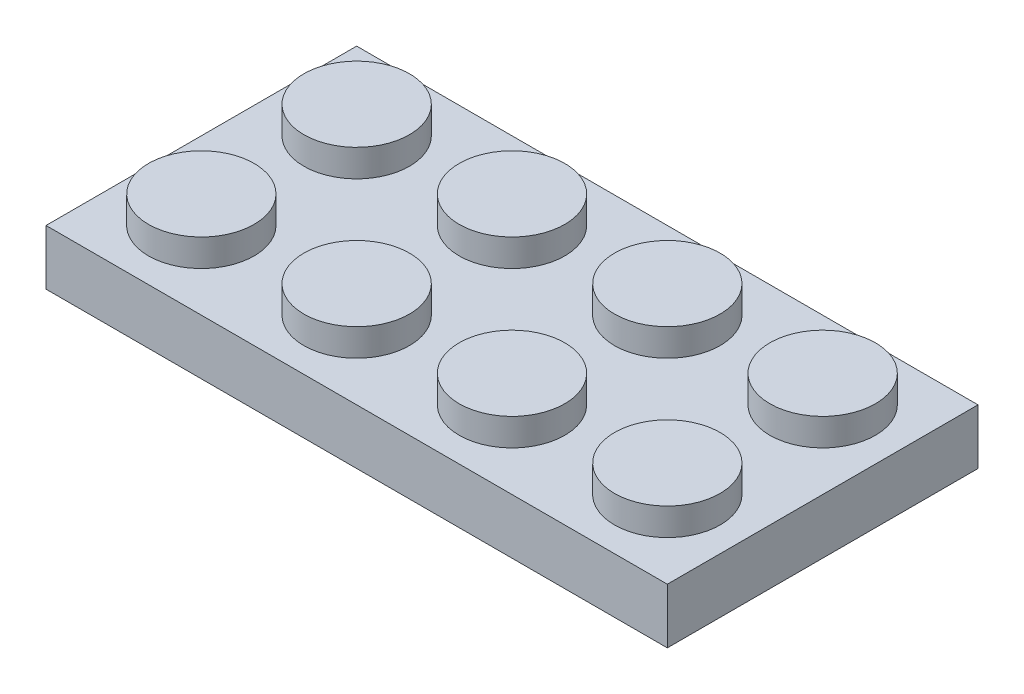
ISO-10303-21;
HEADER;
FILE_DESCRIPTION(('STEP AP214'),'2;1');
FILE_NAME('part.step','',(''),(''),'','','');
FILE_SCHEMA(('AUTOMOTIVE_DESIGN { 1 0 10303 214 1 1 1 1 }'));
ENDSEC;
DATA;
#1=APPLICATION_CONTEXT('core data for automotive mechanical design processes');
#2=APPLICATION_PROTOCOL_DEFINITION('international standard','automotive_design',2000,#1);
#3=PRODUCT_CONTEXT('',#1,'mechanical');
#4=PRODUCT('Part','Part','',(#3));
#5=PRODUCT_RELATED_PRODUCT_CATEGORY('part','',(#4));
#6=PRODUCT_DEFINITION_FORMATION('','',#4);
#7=PRODUCT_DEFINITION_CONTEXT('part definition',#1,'design');
#8=PRODUCT_DEFINITION('design','',#6,#7);
#9=PRODUCT_DEFINITION_SHAPE('','',#8);
#10=(LENGTH_UNIT() NAMED_UNIT(*) SI_UNIT(.MILLI.,.METRE.));
#11=(NAMED_UNIT(*) PLANE_ANGLE_UNIT() SI_UNIT($,.RADIAN.));
#12=(NAMED_UNIT(*) SI_UNIT($,.STERADIAN.) SOLID_ANGLE_UNIT());
#13=UNCERTAINTY_MEASURE_WITH_UNIT(LENGTH_MEASURE(1.E-05),#10,'distance_accuracy_value','');
#14=(GEOMETRIC_REPRESENTATION_CONTEXT(3) GLOBAL_UNCERTAINTY_ASSIGNED_CONTEXT((#13)) GLOBAL_UNIT_ASSIGNED_CONTEXT((#10,
#11,#12)) REPRESENTATION_CONTEXT('',''));
#15=CARTESIAN_POINT('',(0.,0.,0.));
#16=DIRECTION('',(0.,0.,1.));
#17=DIRECTION('',(1.,0.,0.));
#18=AXIS2_PLACEMENT_3D('',#15,#16,#17);
#19=CARTESIAN_POINT('',(15.875,1.4097,7.9375));
#20=DIRECTION('',(0.,1.,0.));
#21=DIRECTION('',(0.,0.,1.));
#22=AXIS2_PLACEMENT_3D('',#19,#20,#21);
#23=PLANE('',#22);
#24=CARTESIAN_POINT('',(11.90625,1.4097,3.96875));
#25=DIRECTION('',(0.,1.,0.));
#26=DIRECTION('',(0.,0.,1.));
#27=AXIS2_PLACEMENT_3D('',#24,#25,#26);
#28=CIRCLE('',#27,2.69875);
#29=CARTESIAN_POINT('',(11.90625,1.4097,6.6675));
#30=VERTEX_POINT('',#29);
#31=EDGE_CURVE('E632',#30,#30,#28,.T.);
#32=ORIENTED_EDGE('',*,*,#31,.F.);
#33=EDGE_LOOP('',(#32));
#34=FACE_BOUND('',#33,.T.);
#35=DIRECTION('',(0.,0.,-1.));
#36=VECTOR('',#35,1.);
#37=CARTESIAN_POINT('',(15.875,1.4097,-7.9375));
#38=LINE('',#37,#36);
#39=CARTESIAN_POINT('',(15.875,1.4097,7.9375));
#40=VERTEX_POINT('',#39);
#41=CARTESIAN_POINT('',(15.875,1.4097,-7.9375));
#42=VERTEX_POINT('',#41);
#43=EDGE_CURVE('E157',#40,#42,#38,.T.);
#44=ORIENTED_EDGE('',*,*,#43,.T.);
#45=DIRECTION('',(-1.,0.,0.));
#46=VECTOR('',#45,1.);
#47=CARTESIAN_POINT('',(-15.875,1.4097,-7.9375));
#48=LINE('',#47,#46);
#49=CARTESIAN_POINT('',(-15.875,1.4097,-7.9375));
#50=VERTEX_POINT('',#49);
#51=EDGE_CURVE('E93',#42,#50,#48,.T.);
#52=ORIENTED_EDGE('',*,*,#51,.T.);
#53=DIRECTION('',(0.,0.,1.));
#54=VECTOR('',#53,1.);
#55=CARTESIAN_POINT('',(-15.875,1.4097,-7.9375));
#56=LINE('',#55,#54);
#57=CARTESIAN_POINT('',(-15.875,1.4097,7.9375));
#58=VERTEX_POINT('',#57);
#59=EDGE_CURVE('E160',#50,#58,#56,.T.);
#60=ORIENTED_EDGE('',*,*,#59,.T.);
#61=DIRECTION('',(1.,0.,0.));
#62=VECTOR('',#61,1.);
#63=CARTESIAN_POINT('',(-15.875,1.4097,7.9375));
#64=LINE('',#63,#62);
#65=EDGE_CURVE('E64',#58,#40,#64,.T.);
#66=ORIENTED_EDGE('',*,*,#65,.T.);
#67=EDGE_LOOP('',(#44,#52,#60,#66));
#68=FACE_BOUND('',#67,.T.);
#69=CARTESIAN_POINT('',(3.96875000000001,1.4097,3.96875));
#70=DIRECTION('',(0.,1.,0.));
#71=DIRECTION('',(0.,0.,1.));
#72=AXIS2_PLACEMENT_3D('',#69,#70,#71);
#73=CIRCLE('',#72,2.69875);
#74=CARTESIAN_POINT('',(3.96875000000001,1.4097,6.6675));
#75=VERTEX_POINT('',#74);
#76=EDGE_CURVE('E624',#75,#75,#73,.T.);
#77=ORIENTED_EDGE('',*,*,#76,.F.);
#78=EDGE_LOOP('',(#77));
#79=FACE_BOUND('',#78,.T.);
#80=CARTESIAN_POINT('',(-3.96874999999999,1.4097,3.96875));
#81=DIRECTION('',(0.,1.,0.));
#82=DIRECTION('',(0.,0.,1.));
#83=AXIS2_PLACEMENT_3D('',#80,#81,#82);
#84=CIRCLE('',#83,2.69875);
#85=CARTESIAN_POINT('',(-3.96874999999999,1.4097,6.6675));
#86=VERTEX_POINT('',#85);
#87=EDGE_CURVE('E179',#86,#86,#84,.T.);
#88=ORIENTED_EDGE('',*,*,#87,.F.);
#89=EDGE_LOOP('',(#88));
#90=FACE_BOUND('',#89,.T.);
#91=CARTESIAN_POINT('',(-11.90625,1.4097,3.96875));
#92=DIRECTION('',(0.,1.,0.));
#93=DIRECTION('',(0.,0.,1.));
#94=AXIS2_PLACEMENT_3D('',#91,#92,#93);
#95=CIRCLE('',#94,2.69875);
#96=CARTESIAN_POINT('',(-11.90625,1.4097,6.6675));
#97=VERTEX_POINT('',#96);
#98=EDGE_CURVE('E185',#97,#97,#95,.T.);
#99=ORIENTED_EDGE('',*,*,#98,.F.);
#100=EDGE_LOOP('',(#99));
#101=FACE_BOUND('',#100,.T.);
#102=CARTESIAN_POINT('',(11.90625,1.4097,-3.96875));
#103=DIRECTION('',(0.,1.,0.));
#104=DIRECTION('',(0.,0.,1.));
#105=AXIS2_PLACEMENT_3D('',#102,#103,#104);
#106=CIRCLE('',#105,2.69875);
#107=CARTESIAN_POINT('',(11.90625,1.4097,-1.27));
#108=VERTEX_POINT('',#107);
#109=EDGE_CURVE('E191',#108,#108,#106,.T.);
#110=ORIENTED_EDGE('',*,*,#109,.F.);
#111=EDGE_LOOP('',(#110));
#112=FACE_BOUND('',#111,.T.);
#113=CARTESIAN_POINT('',(3.96875000000001,1.4097,-3.96875));
#114=DIRECTION('',(0.,1.,0.));
#115=DIRECTION('',(0.,0.,1.));
#116=AXIS2_PLACEMENT_3D('',#113,#114,#115);
#117=CIRCLE('',#116,2.69875);
#118=CARTESIAN_POINT('',(3.96875000000001,1.4097,-1.27));
#119=VERTEX_POINT('',#118);
#120=EDGE_CURVE('E197',#119,#119,#117,.T.);
#121=ORIENTED_EDGE('',*,*,#120,.F.);
#122=EDGE_LOOP('',(#121));
#123=FACE_BOUND('',#122,.T.);
#124=CARTESIAN_POINT('',(-3.96874999999999,1.4097,-3.96875));
#125=DIRECTION('',(0.,1.,0.));
#126=DIRECTION('',(0.,0.,1.));
#127=AXIS2_PLACEMENT_3D('',#124,#125,#126);
#128=CIRCLE('',#127,2.69875);
#129=CARTESIAN_POINT('',(-3.96874999999999,1.4097,-1.27));
#130=VERTEX_POINT('',#129);
#131=EDGE_CURVE('E203',#130,#130,#128,.T.);
#132=ORIENTED_EDGE('',*,*,#131,.F.);
#133=EDGE_LOOP('',(#132));
#134=FACE_BOUND('',#133,.T.);
#135=CARTESIAN_POINT('',(-11.90625,1.4097,-3.96875));
#136=DIRECTION('',(0.,1.,0.));
#137=DIRECTION('',(0.,0.,1.));
#138=AXIS2_PLACEMENT_3D('',#135,#136,#137);
#139=CIRCLE('',#138,2.69875);
#140=CARTESIAN_POINT('',(-11.90625,1.4097,-1.27));
#141=VERTEX_POINT('',#140);
#142=EDGE_CURVE('E209',#141,#141,#139,.T.);
#143=ORIENTED_EDGE('',*,*,#142,.F.);
#144=EDGE_LOOP('',(#143));
#145=FACE_BOUND('',#144,.T.);
#146=ADVANCED_FACE('F40',(#34,#68,#79,#90,#101,#112,#123,#134,#145),#23,.T.);
#147=CARTESIAN_POINT('',(15.875,1.4097,-7.9375));
#148=DIRECTION('',(-1.,0.,0.));
#149=DIRECTION('',(0.,0.,1.));
#150=AXIS2_PLACEMENT_3D('',#147,#148,#149);
#151=PLANE('',#150);
#152=DIRECTION('',(0.,0.,-1.));
#153=VECTOR('',#152,1.);
#154=CARTESIAN_POINT('',(15.875,-1.4097,-7.9375));
#155=LINE('',#154,#153);
#156=CARTESIAN_POINT('',(15.875,-1.4097,7.9375));
#157=VERTEX_POINT('',#156);
#158=CARTESIAN_POINT('',(15.875,-1.4097,-7.9375));
#159=VERTEX_POINT('',#158);
#160=EDGE_CURVE('E156',#157,#159,#155,.T.);
#161=ORIENTED_EDGE('',*,*,#160,.T.);
#162=DIRECTION('',(0.,-1.,0.));
#163=VECTOR('',#162,1.);
#164=CARTESIAN_POINT('',(15.875,1.4097,-7.9375));
#165=LINE('',#164,#163);
#166=EDGE_CURVE('E177',#42,#159,#165,.T.);
#167=ORIENTED_EDGE('',*,*,#166,.F.);
#168=ORIENTED_EDGE('',*,*,#43,.F.);
#169=DIRECTION('',(0.,-1.,0.));
#170=VECTOR('',#169,1.);
#171=CARTESIAN_POINT('',(15.875,1.4097,7.9375));
#172=LINE('',#171,#170);
#173=EDGE_CURVE('E163',#40,#157,#172,.T.);
#174=ORIENTED_EDGE('',*,*,#173,.T.);
#175=EDGE_LOOP('',(#161,#167,#168,#174));
#176=FACE_BOUND('',#175,.T.);
#177=ADVANCED_FACE('F248',(#176),#151,.F.);
#178=CARTESIAN_POINT('',(-15.875,1.4097,-7.9375));
#179=DIRECTION('',(0.,0.,1.));
#180=DIRECTION('',(1.,0.,0.));
#181=AXIS2_PLACEMENT_3D('',#178,#179,#180);
#182=PLANE('',#181);
#183=DIRECTION('',(-1.,0.,0.));
#184=VECTOR('',#183,1.);
#185=CARTESIAN_POINT('',(-15.875,-1.4097,-7.9375));
#186=LINE('',#185,#184);
#187=CARTESIAN_POINT('',(-15.875,-1.4097,-7.9375));
#188=VERTEX_POINT('',#187);
#189=EDGE_CURVE('E166',#159,#188,#186,.T.);
#190=ORIENTED_EDGE('',*,*,#189,.T.);
#191=DIRECTION('',(0.,-1.,0.));
#192=VECTOR('',#191,1.);
#193=CARTESIAN_POINT('',(-15.875,1.4097,-7.9375));
#194=LINE('',#193,#192);
#195=EDGE_CURVE('E174',#50,#188,#194,.T.);
#196=ORIENTED_EDGE('',*,*,#195,.F.);
#197=ORIENTED_EDGE('',*,*,#51,.F.);
#198=ORIENTED_EDGE('',*,*,#166,.T.);
#199=EDGE_LOOP('',(#190,#196,#197,#198));
#200=FACE_BOUND('',#199,.T.);
#201=ADVANCED_FACE('F253',(#200),#182,.F.);
#202=CARTESIAN_POINT('',(-15.875,1.4097,-7.9375));
#203=DIRECTION('',(1.,0.,0.));
#204=DIRECTION('',(0.,0.,-1.));
#205=AXIS2_PLACEMENT_3D('',#202,#203,#204);
#206=PLANE('',#205);
#207=DIRECTION('',(0.,0.,1.));
#208=VECTOR('',#207,1.);
#209=CARTESIAN_POINT('',(-15.875,-1.4097,-7.9375));
#210=LINE('',#209,#208);
#211=CARTESIAN_POINT('',(-15.875,-1.4097,7.9375));
#212=VERTEX_POINT('',#211);
#213=EDGE_CURVE('E168',#188,#212,#210,.T.);
#214=ORIENTED_EDGE('',*,*,#213,.T.);
#215=DIRECTION('',(0.,-1.,0.));
#216=VECTOR('',#215,1.);
#217=CARTESIAN_POINT('',(-15.875,1.4097,7.9375));
#218=LINE('',#217,#216);
#219=EDGE_CURVE('E172',#58,#212,#218,.T.);
#220=ORIENTED_EDGE('',*,*,#219,.F.);
#221=ORIENTED_EDGE('',*,*,#59,.F.);
#222=ORIENTED_EDGE('',*,*,#195,.T.);
#223=EDGE_LOOP('',(#214,#220,#221,#222));
#224=FACE_BOUND('',#223,.T.);
#225=ADVANCED_FACE('F265',(#224),#206,.F.);
#226=CARTESIAN_POINT('',(-15.875,1.4097,7.9375));
#227=DIRECTION('',(0.,0.,-1.));
#228=DIRECTION('',(-1.,0.,0.));
#229=AXIS2_PLACEMENT_3D('',#226,#227,#228);
#230=PLANE('',#229);
#231=DIRECTION('',(1.,0.,0.));
#232=VECTOR('',#231,1.);
#233=CARTESIAN_POINT('',(-15.875,-1.4097,7.9375));
#234=LINE('',#233,#232);
#235=EDGE_CURVE('E85',#212,#157,#234,.T.);
#236=ORIENTED_EDGE('',*,*,#235,.T.);
#237=ORIENTED_EDGE('',*,*,#173,.F.);
#238=ORIENTED_EDGE('',*,*,#65,.F.);
#239=ORIENTED_EDGE('',*,*,#219,.T.);
#240=EDGE_LOOP('',(#236,#237,#238,#239));
#241=FACE_BOUND('',#240,.T.);
#242=ADVANCED_FACE('F261',(#241),#230,.F.);
#243=CARTESIAN_POINT('',(15.875,-1.4097,7.9375));
#244=DIRECTION('',(0.,1.,0.));
#245=DIRECTION('',(0.,0.,1.));
#246=AXIS2_PLACEMENT_3D('',#243,#244,#245);
#247=PLANE('',#246);
#248=DIRECTION('',(0.,0.,1.));
#249=VECTOR('',#248,1.);
#250=CARTESIAN_POINT('',(14.605,-1.4097,-27.7520581765825));
#251=LINE('',#250,#249);
#252=CARTESIAN_POINT('',(14.605,-1.4097,-6.6675));
#253=VERTEX_POINT('',#252);
#254=CARTESIAN_POINT('',(14.605,-1.4097,6.6675));
#255=VERTEX_POINT('',#254);
#256=EDGE_CURVE('E142',#253,#255,#251,.T.);
#257=ORIENTED_EDGE('',*,*,#256,.F.);
#258=DIRECTION('',(1.,0.,0.));
#259=VECTOR('',#258,1.);
#260=CARTESIAN_POINT('',(0.,-1.4097,-6.6675));
#261=LINE('',#260,#259);
#262=CARTESIAN_POINT('',(-14.605,-1.4097,-6.6675));
#263=VERTEX_POINT('',#262);
#264=EDGE_CURVE('E132',#263,#253,#261,.T.);
#265=ORIENTED_EDGE('',*,*,#264,.F.);
#266=DIRECTION('',(0.,0.,-1.));
#267=VECTOR('',#266,1.);
#268=CARTESIAN_POINT('',(-14.605,-1.4097,-27.7520581765825));
#269=LINE('',#268,#267);
#270=CARTESIAN_POINT('',(-14.605,-1.4097,6.6675));
#271=VERTEX_POINT('',#270);
#272=EDGE_CURVE('E146',#271,#263,#269,.T.);
#273=ORIENTED_EDGE('',*,*,#272,.F.);
#274=DIRECTION('',(-1.,0.,0.));
#275=VECTOR('',#274,1.);
#276=CARTESIAN_POINT('',(0.,-1.4097,6.6675));
#277=LINE('',#276,#275);
#278=EDGE_CURVE('E55',#255,#271,#277,.T.);
#279=ORIENTED_EDGE('',*,*,#278,.F.);
#280=EDGE_LOOP('',(#257,#265,#273,#279));
#281=FACE_BOUND('',#280,.T.);
#282=ORIENTED_EDGE('',*,*,#160,.F.);
#283=ORIENTED_EDGE('',*,*,#235,.F.);
#284=ORIENTED_EDGE('',*,*,#213,.F.);
#285=ORIENTED_EDGE('',*,*,#189,.F.);
#286=EDGE_LOOP('',(#282,#283,#284,#285));
#287=FACE_BOUND('',#286,.T.);
#288=ADVANCED_FACE('F258',(#281,#287),#247,.F.);
#289=CARTESIAN_POINT('',(15.875,0.1397,7.9375));
#290=DIRECTION('',(0.,1.,0.));
#291=DIRECTION('',(0.,0.,1.));
#292=AXIS2_PLACEMENT_3D('',#289,#290,#291);
#293=PLANE('',#292);
#294=CARTESIAN_POINT('',(7.9375,0.1397,0.));
#295=DIRECTION('',(0.,1.,0.));
#296=DIRECTION('',(0.,0.,1.));
#297=AXIS2_PLACEMENT_3D('',#294,#295,#296);
#298=CIRCLE('',#297,3.175);
#299=CARTESIAN_POINT('',(7.9375,0.1397,3.175));
#300=VERTEX_POINT('',#299);
#301=EDGE_CURVE('E601',#300,#300,#298,.F.);
#302=ORIENTED_EDGE('',*,*,#301,.F.);
#303=EDGE_LOOP('',(#302));
#304=FACE_BOUND('',#303,.T.);
#305=CARTESIAN_POINT('',(-7.9375,0.1397,0.));
#306=DIRECTION('',(0.,1.,0.));
#307=DIRECTION('',(0.,0.,1.));
#308=AXIS2_PLACEMENT_3D('',#305,#306,#307);
#309=CIRCLE('',#308,3.175);
#310=CARTESIAN_POINT('',(-7.9375,0.1397,3.175));
#311=VERTEX_POINT('',#310);
#312=EDGE_CURVE('E612',#311,#311,#309,.F.);
#313=ORIENTED_EDGE('',*,*,#312,.F.);
#314=EDGE_LOOP('',(#313));
#315=FACE_BOUND('',#314,.T.);
#316=CARTESIAN_POINT('',(0.,0.1397,0.));
#317=DIRECTION('',(0.,1.,0.));
#318=DIRECTION('',(0.,0.,1.));
#319=AXIS2_PLACEMENT_3D('',#316,#317,#318);
#320=CIRCLE('',#319,3.175);
#321=CARTESIAN_POINT('',(0.,0.1397,3.175));
#322=VERTEX_POINT('',#321);
#323=EDGE_CURVE('E615',#322,#322,#320,.F.);
#324=ORIENTED_EDGE('',*,*,#323,.F.);
#325=EDGE_LOOP('',(#324));
#326=FACE_BOUND('',#325,.T.);
#327=DIRECTION('',(0.,0.,-1.));
#328=VECTOR('',#327,1.);
#329=CARTESIAN_POINT('',(-14.605,0.1397,-27.7520581765825));
#330=LINE('',#329,#328);
#331=CARTESIAN_POINT('',(-14.605,0.1397,6.6675));
#332=VERTEX_POINT('',#331);
#333=CARTESIAN_POINT('',(-14.605,0.1397,-6.6675));
#334=VERTEX_POINT('',#333);
#335=EDGE_CURVE('E136',#332,#334,#330,.T.);
#336=ORIENTED_EDGE('',*,*,#335,.T.);
#337=DIRECTION('',(1.,0.,0.));
#338=VECTOR('',#337,1.);
#339=CARTESIAN_POINT('',(0.,0.1397,-6.6675));
#340=LINE('',#339,#338);
#341=CARTESIAN_POINT('',(14.605,0.1397,-6.6675));
#342=VERTEX_POINT('',#341);
#343=EDGE_CURVE('E129',#334,#342,#340,.T.);
#344=ORIENTED_EDGE('',*,*,#343,.T.);
#345=DIRECTION('',(0.,0.,1.));
#346=VECTOR('',#345,1.);
#347=CARTESIAN_POINT('',(14.605,0.1397,-27.7520581765825));
#348=LINE('',#347,#346);
#349=CARTESIAN_POINT('',(14.605,0.1397,6.6675));
#350=VERTEX_POINT('',#349);
#351=EDGE_CURVE('E116',#342,#350,#348,.T.);
#352=ORIENTED_EDGE('',*,*,#351,.T.);
#353=DIRECTION('',(-1.,0.,0.));
#354=VECTOR('',#353,1.);
#355=CARTESIAN_POINT('',(0.,0.1397,6.6675));
#356=LINE('',#355,#354);
#357=EDGE_CURVE('E151',#350,#332,#356,.T.);
#358=ORIENTED_EDGE('',*,*,#357,.T.);
#359=EDGE_LOOP('',(#336,#344,#352,#358));
#360=FACE_BOUND('',#359,.T.);
#361=ADVANCED_FACE('F135',(#304,#315,#326,#360),#293,.F.);
#362=CARTESIAN_POINT('',(0.,33.5196100746172,-6.6675));
#363=DIRECTION('',(0.,0.,-1.));
#364=DIRECTION('',(-1.,0.,0.));
#365=AXIS2_PLACEMENT_3D('',#362,#363,#364);
#366=PLANE('',#365);
#367=DIRECTION('',(0.,-1.,0.));
#368=VECTOR('',#367,1.);
#369=CARTESIAN_POINT('',(-14.605,33.5196100746172,-6.6675));
#370=LINE('',#369,#368);
#371=EDGE_CURVE('E149',#334,#263,#370,.T.);
#372=ORIENTED_EDGE('',*,*,#371,.T.);
#373=ORIENTED_EDGE('',*,*,#264,.T.);
#374=DIRECTION('',(0.,-1.,0.));
#375=VECTOR('',#374,1.);
#376=CARTESIAN_POINT('',(14.605,33.5196100746172,-6.6675));
#377=LINE('',#376,#375);
#378=EDGE_CURVE('E120',#342,#253,#377,.T.);
#379=ORIENTED_EDGE('',*,*,#378,.F.);
#380=ORIENTED_EDGE('',*,*,#343,.F.);
#381=EDGE_LOOP('',(#372,#373,#379,#380));
#382=FACE_BOUND('',#381,.T.);
#383=ADVANCED_FACE('F128',(#382),#366,.F.);
#384=CARTESIAN_POINT('',(14.605,33.5196100746172,-27.7520581765825));
#385=DIRECTION('',(1.,0.,0.));
#386=DIRECTION('',(0.,0.,-1.));
#387=AXIS2_PLACEMENT_3D('',#384,#385,#386);
#388=PLANE('',#387);
#389=ORIENTED_EDGE('',*,*,#378,.T.);
#390=ORIENTED_EDGE('',*,*,#256,.T.);
#391=DIRECTION('',(0.,-1.,0.));
#392=VECTOR('',#391,1.);
#393=CARTESIAN_POINT('',(14.605,33.5196100746172,6.6675));
#394=LINE('',#393,#392);
#395=EDGE_CURVE('E122',#350,#255,#394,.T.);
#396=ORIENTED_EDGE('',*,*,#395,.F.);
#397=ORIENTED_EDGE('',*,*,#351,.F.);
#398=EDGE_LOOP('',(#389,#390,#396,#397));
#399=FACE_BOUND('',#398,.T.);
#400=ADVANCED_FACE('F118',(#399),#388,.F.);
#401=CARTESIAN_POINT('',(0.,33.5196100746172,6.6675));
#402=DIRECTION('',(0.,0.,1.));
#403=DIRECTION('',(1.,0.,0.));
#404=AXIS2_PLACEMENT_3D('',#401,#402,#403);
#405=PLANE('',#404);
#406=ORIENTED_EDGE('',*,*,#395,.T.);
#407=ORIENTED_EDGE('',*,*,#278,.T.);
#408=DIRECTION('',(0.,-1.,0.));
#409=VECTOR('',#408,1.);
#410=CARTESIAN_POINT('',(-14.605,33.5196100746172,6.6675));
#411=LINE('',#410,#409);
#412=EDGE_CURVE('E150',#332,#271,#411,.T.);
#413=ORIENTED_EDGE('',*,*,#412,.F.);
#414=ORIENTED_EDGE('',*,*,#357,.F.);
#415=EDGE_LOOP('',(#406,#407,#413,#414));
#416=FACE_BOUND('',#415,.T.);
#417=ADVANCED_FACE('F407',(#416),#405,.F.);
#418=CARTESIAN_POINT('',(-14.605,33.5196100746172,-27.7520581765825));
#419=DIRECTION('',(-1.,0.,0.));
#420=DIRECTION('',(0.,0.,1.));
#421=AXIS2_PLACEMENT_3D('',#418,#419,#420);
#422=PLANE('',#421);
#423=ORIENTED_EDGE('',*,*,#412,.T.);
#424=ORIENTED_EDGE('',*,*,#272,.T.);
#425=ORIENTED_EDGE('',*,*,#371,.F.);
#426=ORIENTED_EDGE('',*,*,#335,.F.);
#427=EDGE_LOOP('',(#423,#424,#425,#426));
#428=FACE_BOUND('',#427,.T.);
#429=ADVANCED_FACE('F399',(#428),#422,.F.);
#430=CARTESIAN_POINT('',(11.90625,2.8067,3.96875));
#431=DIRECTION('',(0.,-1.,0.));
#432=DIRECTION('',(0.,0.,-1.));
#433=AXIS2_PLACEMENT_3D('',#430,#431,#432);
#434=CYLINDRICAL_SURFACE('',#433,2.69875);
#435=CARTESIAN_POINT('',(11.90625,2.8067,3.96875));
#436=DIRECTION('',(0.,1.,0.));
#437=DIRECTION('',(0.,0.,1.));
#438=AXIS2_PLACEMENT_3D('',#435,#436,#437);
#439=CIRCLE('',#438,2.69875);
#440=CARTESIAN_POINT('',(11.90625,2.8067,6.6675));
#441=VERTEX_POINT('',#440);
#442=EDGE_CURVE('E633',#441,#441,#439,.T.);
#443=ORIENTED_EDGE('',*,*,#442,.F.);
#444=EDGE_LOOP('',(#443));
#445=FACE_BOUND('',#444,.T.);
#446=ORIENTED_EDGE('',*,*,#31,.T.);
#447=EDGE_LOOP('',(#446));
#448=FACE_BOUND('',#447,.T.);
#449=ADVANCED_FACE('F391',(#445,#448),#434,.T.);
#450=CARTESIAN_POINT('',(11.90625,2.8067,3.96875));
#451=DIRECTION('',(0.,1.,0.));
#452=DIRECTION('',(0.,0.,1.));
#453=AXIS2_PLACEMENT_3D('',#450,#451,#452);
#454=PLANE('',#453);
#455=ORIENTED_EDGE('',*,*,#442,.T.);
#456=EDGE_LOOP('',(#455));
#457=FACE_BOUND('',#456,.T.);
#458=ADVANCED_FACE('F383',(#457),#454,.T.);
#459=CARTESIAN_POINT('',(3.96875000000001,2.8067,3.96875));
#460=DIRECTION('',(0.,-1.,0.));
#461=DIRECTION('',(0.,0.,-1.));
#462=AXIS2_PLACEMENT_3D('',#459,#460,#461);
#463=CYLINDRICAL_SURFACE('',#462,2.69875);
#464=CARTESIAN_POINT('',(3.96875000000001,2.8067,3.96875));
#465=DIRECTION('',(0.,1.,0.));
#466=DIRECTION('',(0.,0.,1.));
#467=AXIS2_PLACEMENT_3D('',#464,#465,#466);
#468=CIRCLE('',#467,2.69875);
#469=CARTESIAN_POINT('',(3.96875000000001,2.8067,6.6675));
#470=VERTEX_POINT('',#469);
#471=EDGE_CURVE('E629',#470,#470,#468,.T.);
#472=ORIENTED_EDGE('',*,*,#471,.F.);
#473=EDGE_LOOP('',(#472));
#474=FACE_BOUND('',#473,.T.);
#475=ORIENTED_EDGE('',*,*,#76,.T.);
#476=EDGE_LOOP('',(#475));
#477=FACE_BOUND('',#476,.T.);
#478=ADVANCED_FACE('F375',(#474,#477),#463,.T.);
#479=CARTESIAN_POINT('',(3.96875000000001,2.8067,3.96875));
#480=DIRECTION('',(0.,1.,0.));
#481=DIRECTION('',(0.,0.,1.));
#482=AXIS2_PLACEMENT_3D('',#479,#480,#481);
#483=PLANE('',#482);
#484=ORIENTED_EDGE('',*,*,#471,.T.);
#485=EDGE_LOOP('',(#484));
#486=FACE_BOUND('',#485,.T.);
#487=ADVANCED_FACE('F279',(#486),#483,.T.);
#488=CARTESIAN_POINT('',(-3.96874999999999,2.8067,3.96875));
#489=DIRECTION('',(0.,1.,0.));
#490=DIRECTION('',(0.,0.,1.));
#491=AXIS2_PLACEMENT_3D('',#488,#489,#490);
#492=PLANE('',#491);
#493=CARTESIAN_POINT('',(-3.96874999999999,2.8067,3.96875));
#494=DIRECTION('',(0.,1.,0.));
#495=DIRECTION('',(0.,0.,1.));
#496=AXIS2_PLACEMENT_3D('',#493,#494,#495);
#497=CIRCLE('',#496,2.69875);
#498=CARTESIAN_POINT('',(-3.96874999999999,2.8067,6.6675));
#499=VERTEX_POINT('',#498);
#500=EDGE_CURVE('E182',#499,#499,#497,.T.);
#501=ORIENTED_EDGE('',*,*,#500,.T.);
#502=EDGE_LOOP('',(#501));
#503=FACE_BOUND('',#502,.T.);
#504=ADVANCED_FACE('F275',(#503),#492,.T.);
#505=CARTESIAN_POINT('',(-3.96874999999999,2.8067,3.96875));
#506=DIRECTION('',(0.,-1.,0.));
#507=DIRECTION('',(0.,0.,-1.));
#508=AXIS2_PLACEMENT_3D('',#505,#506,#507);
#509=CYLINDRICAL_SURFACE('',#508,2.69875);
#510=ORIENTED_EDGE('',*,*,#500,.F.);
#511=EDGE_LOOP('',(#510));
#512=FACE_BOUND('',#511,.T.);
#513=ORIENTED_EDGE('',*,*,#87,.T.);
#514=EDGE_LOOP('',(#513));
#515=FACE_BOUND('',#514,.T.);
#516=ADVANCED_FACE('F271',(#512,#515),#509,.T.);
#517=CARTESIAN_POINT('',(-11.90625,2.8067,3.96875));
#518=DIRECTION('',(0.,1.,0.));
#519=DIRECTION('',(0.,0.,1.));
#520=AXIS2_PLACEMENT_3D('',#517,#518,#519);
#521=PLANE('',#520);
#522=CARTESIAN_POINT('',(-11.90625,2.8067,3.96875));
#523=DIRECTION('',(0.,1.,0.));
#524=DIRECTION('',(0.,0.,1.));
#525=AXIS2_PLACEMENT_3D('',#522,#523,#524);
#526=CIRCLE('',#525,2.69875);
#527=CARTESIAN_POINT('',(-11.90625,2.8067,6.6675));
#528=VERTEX_POINT('',#527);
#529=EDGE_CURVE('E188',#528,#528,#526,.T.);
#530=ORIENTED_EDGE('',*,*,#529,.T.);
#531=EDGE_LOOP('',(#530));
#532=FACE_BOUND('',#531,.T.);
#533=ADVANCED_FACE('F274',(#532),#521,.T.);
#534=CARTESIAN_POINT('',(-11.90625,2.8067,3.96875));
#535=DIRECTION('',(0.,-1.,0.));
#536=DIRECTION('',(0.,0.,-1.));
#537=AXIS2_PLACEMENT_3D('',#534,#535,#536);
#538=CYLINDRICAL_SURFACE('',#537,2.69875);
#539=ORIENTED_EDGE('',*,*,#529,.F.);
#540=EDGE_LOOP('',(#539));
#541=FACE_BOUND('',#540,.T.);
#542=ORIENTED_EDGE('',*,*,#98,.T.);
#543=EDGE_LOOP('',(#542));
#544=FACE_BOUND('',#543,.T.);
#545=ADVANCED_FACE('F281',(#541,#544),#538,.T.);
#546=CARTESIAN_POINT('',(11.90625,2.8067,-3.96875));
#547=DIRECTION('',(0.,1.,0.));
#548=DIRECTION('',(0.,0.,1.));
#549=AXIS2_PLACEMENT_3D('',#546,#547,#548);
#550=PLANE('',#549);
#551=CARTESIAN_POINT('',(11.90625,2.8067,-3.96875));
#552=DIRECTION('',(0.,1.,0.));
#553=DIRECTION('',(0.,0.,1.));
#554=AXIS2_PLACEMENT_3D('',#551,#552,#553);
#555=CIRCLE('',#554,2.69875);
#556=CARTESIAN_POINT('',(11.90625,2.8067,-1.27));
#557=VERTEX_POINT('',#556);
#558=EDGE_CURVE('E194',#557,#557,#555,.T.);
#559=ORIENTED_EDGE('',*,*,#558,.T.);
#560=EDGE_LOOP('',(#559));
#561=FACE_BOUND('',#560,.T.);
#562=ADVANCED_FACE('F284',(#561),#550,.T.);
#563=CARTESIAN_POINT('',(11.90625,2.8067,-3.96875));
#564=DIRECTION('',(0.,-1.,0.));
#565=DIRECTION('',(0.,0.,-1.));
#566=AXIS2_PLACEMENT_3D('',#563,#564,#565);
#567=CYLINDRICAL_SURFACE('',#566,2.69875);
#568=ORIENTED_EDGE('',*,*,#558,.F.);
#569=EDGE_LOOP('',(#568));
#570=FACE_BOUND('',#569,.T.);
#571=ORIENTED_EDGE('',*,*,#109,.T.);
#572=EDGE_LOOP('',(#571));
#573=FACE_BOUND('',#572,.T.);
#574=ADVANCED_FACE('F289',(#570,#573),#567,.T.);
#575=CARTESIAN_POINT('',(3.96875000000001,2.8067,-3.96875));
#576=DIRECTION('',(0.,1.,0.));
#577=DIRECTION('',(0.,0.,1.));
#578=AXIS2_PLACEMENT_3D('',#575,#576,#577);
#579=PLANE('',#578);
#580=CARTESIAN_POINT('',(3.96875000000001,2.8067,-3.96875));
#581=DIRECTION('',(0.,1.,0.));
#582=DIRECTION('',(0.,0.,1.));
#583=AXIS2_PLACEMENT_3D('',#580,#581,#582);
#584=CIRCLE('',#583,2.69875);
#585=CARTESIAN_POINT('',(3.96875000000001,2.8067,-1.27));
#586=VERTEX_POINT('',#585);
#587=EDGE_CURVE('E200',#586,#586,#584,.T.);
#588=ORIENTED_EDGE('',*,*,#587,.T.);
#589=EDGE_LOOP('',(#588));
#590=FACE_BOUND('',#589,.T.);
#591=ADVANCED_FACE('F292',(#590),#579,.T.);
#592=CARTESIAN_POINT('',(3.96875000000001,2.8067,-3.96875));
#593=DIRECTION('',(0.,-1.,0.));
#594=DIRECTION('',(0.,0.,-1.));
#595=AXIS2_PLACEMENT_3D('',#592,#593,#594);
#596=CYLINDRICAL_SURFACE('',#595,2.69875);
#597=ORIENTED_EDGE('',*,*,#587,.F.);
#598=EDGE_LOOP('',(#597));
#599=FACE_BOUND('',#598,.T.);
#600=ORIENTED_EDGE('',*,*,#120,.T.);
#601=EDGE_LOOP('',(#600));
#602=FACE_BOUND('',#601,.T.);
#603=ADVANCED_FACE('F297',(#599,#602),#596,.T.);
#604=CARTESIAN_POINT('',(-3.96874999999999,2.8067,-3.96875));
#605=DIRECTION('',(0.,1.,0.));
#606=DIRECTION('',(0.,0.,1.));
#607=AXIS2_PLACEMENT_3D('',#604,#605,#606);
#608=PLANE('',#607);
#609=CARTESIAN_POINT('',(-3.96874999999999,2.8067,-3.96875));
#610=DIRECTION('',(0.,1.,0.));
#611=DIRECTION('',(0.,0.,1.));
#612=AXIS2_PLACEMENT_3D('',#609,#610,#611);
#613=CIRCLE('',#612,2.69875);
#614=CARTESIAN_POINT('',(-3.96874999999999,2.8067,-1.27));
#615=VERTEX_POINT('',#614);
#616=EDGE_CURVE('E206',#615,#615,#613,.T.);
#617=ORIENTED_EDGE('',*,*,#616,.T.);
#618=EDGE_LOOP('',(#617));
#619=FACE_BOUND('',#618,.T.);
#620=ADVANCED_FACE('F300',(#619),#608,.T.);
#621=CARTESIAN_POINT('',(-3.96874999999999,2.8067,-3.96875));
#622=DIRECTION('',(0.,-1.,0.));
#623=DIRECTION('',(0.,0.,-1.));
#624=AXIS2_PLACEMENT_3D('',#621,#622,#623);
#625=CYLINDRICAL_SURFACE('',#624,2.69875);
#626=ORIENTED_EDGE('',*,*,#616,.F.);
#627=EDGE_LOOP('',(#626));
#628=FACE_BOUND('',#627,.T.);
#629=ORIENTED_EDGE('',*,*,#131,.T.);
#630=EDGE_LOOP('',(#629));
#631=FACE_BOUND('',#630,.T.);
#632=ADVANCED_FACE('F305',(#628,#631),#625,.T.);
#633=CARTESIAN_POINT('',(-11.90625,2.8067,-3.96875));
#634=DIRECTION('',(0.,1.,0.));
#635=DIRECTION('',(0.,0.,1.));
#636=AXIS2_PLACEMENT_3D('',#633,#634,#635);
#637=PLANE('',#636);
#638=CARTESIAN_POINT('',(-11.90625,2.8067,-3.96875));
#639=DIRECTION('',(0.,1.,0.));
#640=DIRECTION('',(0.,0.,1.));
#641=AXIS2_PLACEMENT_3D('',#638,#639,#640);
#642=CIRCLE('',#641,2.69875);
#643=CARTESIAN_POINT('',(-11.90625,2.8067,-1.27));
#644=VERTEX_POINT('',#643);
#645=EDGE_CURVE('E212',#644,#644,#642,.T.);
#646=ORIENTED_EDGE('',*,*,#645,.T.);
#647=EDGE_LOOP('',(#646));
#648=FACE_BOUND('',#647,.T.);
#649=ADVANCED_FACE('F42',(#648),#637,.T.);
#650=CARTESIAN_POINT('',(-11.90625,2.8067,-3.96875));
#651=DIRECTION('',(0.,-1.,0.));
#652=DIRECTION('',(0.,0.,-1.));
#653=AXIS2_PLACEMENT_3D('',#650,#651,#652);
#654=CYLINDRICAL_SURFACE('',#653,2.69875);
#655=ORIENTED_EDGE('',*,*,#645,.F.);
#656=EDGE_LOOP('',(#655));
#657=FACE_BOUND('',#656,.T.);
#658=ORIENTED_EDGE('',*,*,#142,.T.);
#659=EDGE_LOOP('',(#658));
#660=FACE_BOUND('',#659,.T.);
#661=ADVANCED_FACE('F311',(#657,#660),#654,.T.);
#662=CARTESIAN_POINT('',(0.,9.11995612106915,0.));
#663=DIRECTION('',(0.,-1.,0.));
#664=DIRECTION('',(0.,0.,-1.));
#665=AXIS2_PLACEMENT_3D('',#662,#663,#664);
#666=CYLINDRICAL_SURFACE('',#665,2.413);
#667=CARTESIAN_POINT('',(0.,-1.4097,0.));
#668=DIRECTION('',(0.,-1.,0.));
#669=DIRECTION('',(0.,0.,-1.));
#670=AXIS2_PLACEMENT_3D('',#667,#668,#669);
#671=CIRCLE('',#670,2.413);
#672=CARTESIAN_POINT('',(0.,-1.4097,-2.413));
#673=VERTEX_POINT('',#672);
#674=EDGE_CURVE('E618',#673,#673,#671,.T.);
#675=ORIENTED_EDGE('',*,*,#674,.T.);
#676=EDGE_LOOP('',(#675));
#677=FACE_BOUND('',#676,.T.);
#678=CARTESIAN_POINT('',(0.,0.1397,0.));
#679=DIRECTION('',(0.,1.,0.));
#680=DIRECTION('',(0.,0.,1.));
#681=AXIS2_PLACEMENT_3D('',#678,#679,#680);
#682=CIRCLE('',#681,2.413);
#683=CARTESIAN_POINT('',(0.,0.1397,2.413));
#684=VERTEX_POINT('',#683);
#685=EDGE_CURVE('E215',#684,#684,#682,.T.);
#686=ORIENTED_EDGE('',*,*,#685,.T.);
#687=EDGE_LOOP('',(#686));
#688=FACE_BOUND('',#687,.T.);
#689=ADVANCED_FACE('F313',(#677,#688),#666,.F.);
#690=CARTESIAN_POINT('',(0.,-1.4097,-27.7520581765825));
#691=DIRECTION('',(0.,-1.,0.));
#692=DIRECTION('',(0.,0.,-1.));
#693=AXIS2_PLACEMENT_3D('',#690,#691,#692);
#694=PLANE('',#693);
#695=ORIENTED_EDGE('',*,*,#674,.F.);
#696=EDGE_LOOP('',(#695));
#697=FACE_BOUND('',#696,.T.);
#698=CARTESIAN_POINT('',(0.,-1.4097,0.));
#699=DIRECTION('',(0.,-1.,0.));
#700=DIRECTION('',(0.,0.,-1.));
#701=AXIS2_PLACEMENT_3D('',#698,#699,#700);
#702=CIRCLE('',#701,3.175);
#703=CARTESIAN_POINT('',(0.,-1.4097,-3.175));
#704=VERTEX_POINT('',#703);
#705=EDGE_CURVE('E621',#704,#704,#702,.T.);
#706=ORIENTED_EDGE('',*,*,#705,.T.);
#707=EDGE_LOOP('',(#706));
#708=FACE_BOUND('',#707,.T.);
#709=ADVANCED_FACE('F319',(#697,#708),#694,.T.);
#710=CARTESIAN_POINT('',(0.,9.11995612106915,0.));
#711=DIRECTION('',(0.,-1.,0.));
#712=DIRECTION('',(0.,0.,-1.));
#713=AXIS2_PLACEMENT_3D('',#710,#711,#712);
#714=CYLINDRICAL_SURFACE('',#713,3.175);
#715=ORIENTED_EDGE('',*,*,#705,.F.);
#716=EDGE_LOOP('',(#715));
#717=FACE_BOUND('',#716,.T.);
#718=ORIENTED_EDGE('',*,*,#323,.T.);
#719=EDGE_LOOP('',(#718));
#720=FACE_BOUND('',#719,.T.);
#721=ADVANCED_FACE('F242',(#717,#720),#714,.T.);
#722=ORIENTED_EDGE('',*,*,#685,.F.);
#723=EDGE_LOOP('',(#722));
#724=FACE_BOUND('',#723,.T.);
#725=ADVANCED_FACE('F227',(#724),#293,.F.);
#726=CARTESIAN_POINT('',(-7.9375,9.11995612106915,0.));
#727=DIRECTION('',(0.,-1.,0.));
#728=DIRECTION('',(0.,0.,-1.));
#729=AXIS2_PLACEMENT_3D('',#726,#727,#728);
#730=CYLINDRICAL_SURFACE('',#729,2.413);
#731=CARTESIAN_POINT('',(-7.9375,-1.4097,0.));
#732=DIRECTION('',(0.,-1.,0.));
#733=DIRECTION('',(0.,0.,-1.));
#734=AXIS2_PLACEMENT_3D('',#731,#732,#733);
#735=CIRCLE('',#734,2.413);
#736=CARTESIAN_POINT('',(-7.9375,-1.4097,-2.413));
#737=VERTEX_POINT('',#736);
#738=EDGE_CURVE('E608',#737,#737,#735,.T.);
#739=ORIENTED_EDGE('',*,*,#738,.T.);
#740=EDGE_LOOP('',(#739));
#741=FACE_BOUND('',#740,.T.);
#742=CARTESIAN_POINT('',(-7.9375,0.1397,0.));
#743=DIRECTION('',(0.,1.,0.));
#744=DIRECTION('',(0.,0.,1.));
#745=AXIS2_PLACEMENT_3D('',#742,#743,#744);
#746=CIRCLE('',#745,2.413);
#747=CARTESIAN_POINT('',(-7.9375,0.1397,2.413));
#748=VERTEX_POINT('',#747);
#749=EDGE_CURVE('E48',#748,#748,#746,.T.);
#750=ORIENTED_EDGE('',*,*,#749,.T.);
#751=EDGE_LOOP('',(#750));
#752=FACE_BOUND('',#751,.T.);
#753=ADVANCED_FACE('F220',(#741,#752),#730,.F.);
#754=CARTESIAN_POINT('',(-7.93749999999999,-1.4097,-27.7520581765825));
#755=DIRECTION('',(0.,-1.,0.));
#756=DIRECTION('',(0.,0.,-1.));
#757=AXIS2_PLACEMENT_3D('',#754,#755,#756);
#758=PLANE('',#757);
#759=ORIENTED_EDGE('',*,*,#738,.F.);
#760=EDGE_LOOP('',(#759));
#761=FACE_BOUND('',#760,.T.);
#762=CARTESIAN_POINT('',(-7.9375,-1.4097,0.));
#763=DIRECTION('',(0.,-1.,0.));
#764=DIRECTION('',(0.,0.,-1.));
#765=AXIS2_PLACEMENT_3D('',#762,#763,#764);
#766=CIRCLE('',#765,3.175);
#767=CARTESIAN_POINT('',(-7.9375,-1.4097,-3.175));
#768=VERTEX_POINT('',#767);
#769=EDGE_CURVE('E611',#768,#768,#766,.T.);
#770=ORIENTED_EDGE('',*,*,#769,.T.);
#771=EDGE_LOOP('',(#770));
#772=FACE_BOUND('',#771,.T.);
#773=ADVANCED_FACE('F236',(#761,#772),#758,.T.);
#774=CARTESIAN_POINT('',(-7.9375,9.11995612106915,0.));
#775=DIRECTION('',(0.,-1.,0.));
#776=DIRECTION('',(0.,0.,-1.));
#777=AXIS2_PLACEMENT_3D('',#774,#775,#776);
#778=CYLINDRICAL_SURFACE('',#777,3.175);
#779=ORIENTED_EDGE('',*,*,#769,.F.);
#780=EDGE_LOOP('',(#779));
#781=FACE_BOUND('',#780,.T.);
#782=ORIENTED_EDGE('',*,*,#312,.T.);
#783=EDGE_LOOP('',(#782));
#784=FACE_BOUND('',#783,.T.);
#785=ADVANCED_FACE('F225',(#781,#784),#778,.T.);
#786=ORIENTED_EDGE('',*,*,#749,.F.);
#787=EDGE_LOOP('',(#786));
#788=FACE_BOUND('',#787,.T.);
#789=ADVANCED_FACE('F222',(#788),#293,.F.);
#790=CARTESIAN_POINT('',(7.9375,9.11995612106915,0.));
#791=DIRECTION('',(0.,-1.,0.));
#792=DIRECTION('',(0.,0.,-1.));
#793=AXIS2_PLACEMENT_3D('',#790,#791,#792);
#794=CYLINDRICAL_SURFACE('',#793,2.413);
#795=CARTESIAN_POINT('',(7.9375,-1.4097,0.));
#796=DIRECTION('',(0.,-1.,0.));
#797=DIRECTION('',(0.,0.,-1.));
#798=AXIS2_PLACEMENT_3D('',#795,#796,#797);
#799=CIRCLE('',#798,2.413);
#800=CARTESIAN_POINT('',(7.9375,-1.4097,-2.413));
#801=VERTEX_POINT('',#800);
#802=EDGE_CURVE('E602',#801,#801,#799,.T.);
#803=ORIENTED_EDGE('',*,*,#802,.T.);
#804=EDGE_LOOP('',(#803));
#805=FACE_BOUND('',#804,.T.);
#806=CARTESIAN_POINT('',(7.9375,0.1397,0.));
#807=DIRECTION('',(0.,1.,0.));
#808=DIRECTION('',(0.,0.,1.));
#809=AXIS2_PLACEMENT_3D('',#806,#807,#808);
#810=CIRCLE('',#809,2.413);
#811=CARTESIAN_POINT('',(7.9375,0.1397,2.413));
#812=VERTEX_POINT('',#811);
#813=EDGE_CURVE('E12',#812,#812,#810,.T.);
#814=ORIENTED_EDGE('',*,*,#813,.T.);
#815=EDGE_LOOP('',(#814));
#816=FACE_BOUND('',#815,.T.);
#817=ADVANCED_FACE('F224',(#805,#816),#794,.F.);
#818=CARTESIAN_POINT('',(7.93750000000001,-1.4097,-27.7520581765825));
#819=DIRECTION('',(0.,-1.,0.));
#820=DIRECTION('',(0.,0.,-1.));
#821=AXIS2_PLACEMENT_3D('',#818,#819,#820);
#822=PLANE('',#821);
#823=ORIENTED_EDGE('',*,*,#802,.F.);
#824=EDGE_LOOP('',(#823));
#825=FACE_BOUND('',#824,.T.);
#826=CARTESIAN_POINT('',(7.9375,-1.4097,0.));
#827=DIRECTION('',(0.,-1.,0.));
#828=DIRECTION('',(0.,0.,-1.));
#829=AXIS2_PLACEMENT_3D('',#826,#827,#828);
#830=CIRCLE('',#829,3.175);
#831=CARTESIAN_POINT('',(7.9375,-1.4097,-3.175));
#832=VERTEX_POINT('',#831);
#833=EDGE_CURVE('E598',#832,#832,#830,.T.);
#834=ORIENTED_EDGE('',*,*,#833,.T.);
#835=EDGE_LOOP('',(#834));
#836=FACE_BOUND('',#835,.T.);
#837=ADVANCED_FACE('F233',(#825,#836),#822,.T.);
#838=CARTESIAN_POINT('',(7.9375,9.11995612106915,0.));
#839=DIRECTION('',(0.,-1.,0.));
#840=DIRECTION('',(0.,0.,-1.));
#841=AXIS2_PLACEMENT_3D('',#838,#839,#840);
#842=CYLINDRICAL_SURFACE('',#841,3.175);
#843=ORIENTED_EDGE('',*,*,#833,.F.);
#844=EDGE_LOOP('',(#843));
#845=FACE_BOUND('',#844,.T.);
#846=ORIENTED_EDGE('',*,*,#301,.T.);
#847=EDGE_LOOP('',(#846));
#848=FACE_BOUND('',#847,.T.);
#849=ADVANCED_FACE('F245',(#845,#848),#842,.T.);
#850=ORIENTED_EDGE('',*,*,#813,.F.);
#851=EDGE_LOOP('',(#850));
#852=FACE_BOUND('',#851,.T.);
#853=ADVANCED_FACE('F228',(#852),#293,.F.);
#854=CLOSED_SHELL('',(#146,#177,#201,#225,#242,#288,#361,#383,#400,#417,#429,#449,#458,#478,
#487,#504,#516,#533,#545,#562,#574,#591,#603,#620,#632,#649,#661,#689,#709,#721,#725,#753,#773,
#785,#789,#817,#837,#849,#853));
#855=MANIFOLD_SOLID_BREP('B2',#854);
#856=ADVANCED_BREP_SHAPE_REPRESENTATION('',(#18,#855),#14);
#857=SHAPE_DEFINITION_REPRESENTATION(#9,#856);
ENDSEC;
END-ISO-10303-21;
